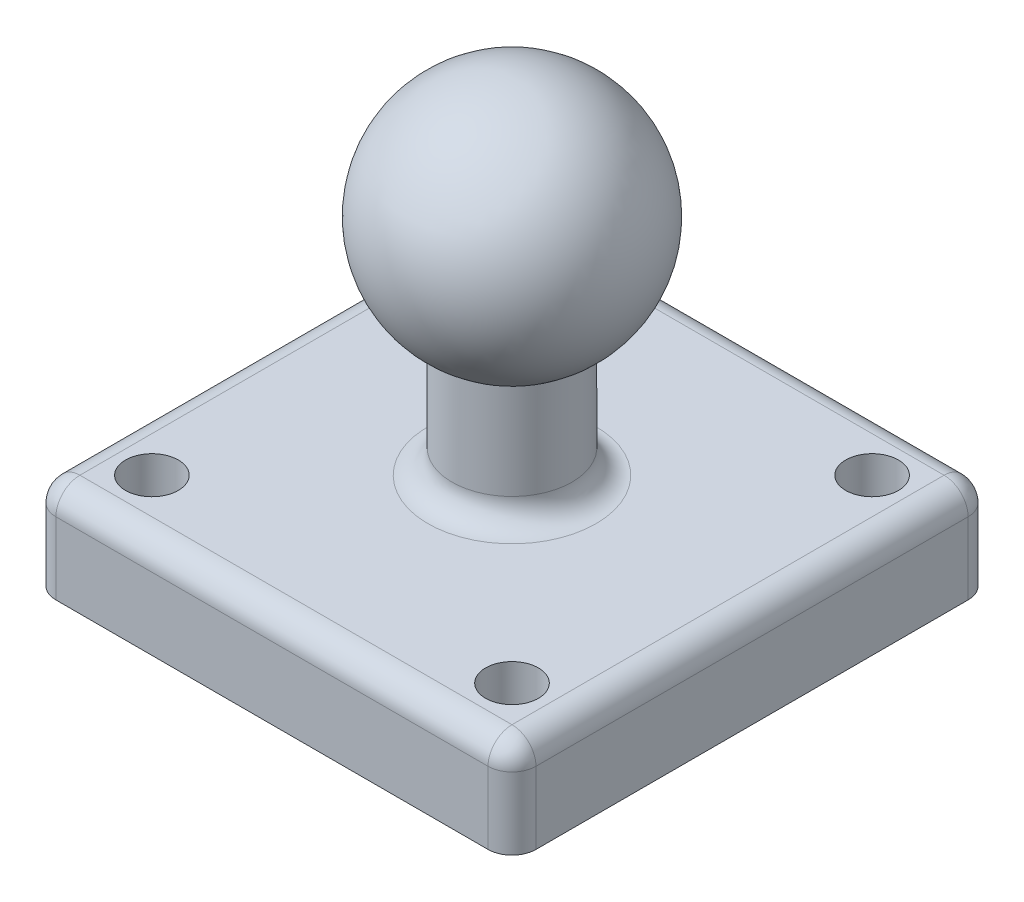
ISO-10303-21;
HEADER;
FILE_DESCRIPTION(('STEP AP214'),'2;1');
FILE_NAME('part.step','',(''),(''),'','','');
FILE_SCHEMA(('AUTOMOTIVE_DESIGN { 1 0 10303 214 1 1 1 1 }'));
ENDSEC;
DATA;
#1=APPLICATION_CONTEXT('core data for automotive mechanical design processes');
#2=APPLICATION_PROTOCOL_DEFINITION('international standard','automotive_design',2000,#1);
#3=PRODUCT_CONTEXT('',#1,'mechanical');
#4=PRODUCT('Part','Part','',(#3));
#5=PRODUCT_RELATED_PRODUCT_CATEGORY('part','',(#4));
#6=PRODUCT_DEFINITION_FORMATION('','',#4);
#7=PRODUCT_DEFINITION_CONTEXT('part definition',#1,'design');
#8=PRODUCT_DEFINITION('design','',#6,#7);
#9=PRODUCT_DEFINITION_SHAPE('','',#8);
#10=(LENGTH_UNIT() NAMED_UNIT(*) SI_UNIT(.MILLI.,.METRE.));
#11=(NAMED_UNIT(*) PLANE_ANGLE_UNIT() SI_UNIT($,.RADIAN.));
#12=(NAMED_UNIT(*) SI_UNIT($,.STERADIAN.) SOLID_ANGLE_UNIT());
#13=UNCERTAINTY_MEASURE_WITH_UNIT(LENGTH_MEASURE(1.E-05),#10,'distance_accuracy_value','');
#14=(GEOMETRIC_REPRESENTATION_CONTEXT(3) GLOBAL_UNCERTAINTY_ASSIGNED_CONTEXT((#13)) GLOBAL_UNIT_ASSIGNED_CONTEXT((#10,
#11,#12)) REPRESENTATION_CONTEXT('',''));
#15=CARTESIAN_POINT('',(0.,0.,0.));
#16=DIRECTION('',(0.,0.,1.));
#17=DIRECTION('',(1.,0.,0.));
#18=AXIS2_PLACEMENT_3D('',#15,#16,#17);
#19=CARTESIAN_POINT('',(0.,0.,0.));
#20=DIRECTION('',(0.,-1.,0.));
#21=DIRECTION('',(-1.,0.,0.));
#22=AXIS2_PLACEMENT_3D('',#19,#20,#21);
#23=SPHERICAL_SURFACE('',#22,5.);
#24=CARTESIAN_POINT('',(0.,-4.33012701892219,0.));
#25=DIRECTION('',(0.,-1.,0.));
#26=DIRECTION('',(1.,0.,0.));
#27=AXIS2_PLACEMENT_3D('',#24,#25,#26);
#28=CIRCLE('',#27,2.49999999999999);
#29=CARTESIAN_POINT('',(2.49999999999999,-4.33012701892219,0.));
#30=VERTEX_POINT('',#29);
#31=EDGE_CURVE('E234',#30,#30,#28,.T.);
#32=ORIENTED_EDGE('',*,*,#31,.F.);
#33=EDGE_LOOP('',(#32));
#34=FACE_BOUND('',#33,.T.);
#35=ADVANCED_FACE('F35',(#34),#23,.T.);
#36=CARTESIAN_POINT('',(0.,-9.33012701892219,0.));
#37=DIRECTION('',(0.,-1.,0.));
#38=DIRECTION('',(1.,0.,0.));
#39=AXIS2_PLACEMENT_3D('',#36,#37,#38);
#40=CYLINDRICAL_SURFACE('',#39,2.5);
#41=CARTESIAN_POINT('',(0.,-8.33012701892219,0.));
#42=DIRECTION('',(0.,-1.,0.));
#43=DIRECTION('',(1.,0.,0.));
#44=AXIS2_PLACEMENT_3D('',#41,#42,#43);
#45=CIRCLE('',#44,2.5);
#46=CARTESIAN_POINT('',(2.5,-8.33012701892219,0.));
#47=VERTEX_POINT('',#46);
#48=EDGE_CURVE('E172',#47,#47,#45,.F.);
#49=ORIENTED_EDGE('',*,*,#48,.T.);
#50=EDGE_LOOP('',(#49));
#51=FACE_BOUND('',#50,.T.);
#52=ORIENTED_EDGE('',*,*,#31,.T.);
#53=EDGE_LOOP('',(#52));
#54=FACE_BOUND('',#53,.T.);
#55=ADVANCED_FACE('F291',(#51,#54),#40,.T.);
#56=CARTESIAN_POINT('',(-9.99999999999999,-13.3301270189222,10.));
#57=DIRECTION('',(1.,0.,0.));
#58=DIRECTION('',(0.,1.,0.));
#59=AXIS2_PLACEMENT_3D('',#56,#57,#58);
#60=PLANE('',#59);
#61=DIRECTION('',(0.,0.,-1.));
#62=VECTOR('',#61,1.);
#63=CARTESIAN_POINT('',(-9.99999999999999,-13.3301270189222,10.));
#64=LINE('',#63,#62);
#65=CARTESIAN_POINT('',(-9.99999999999999,-13.3301270189222,9.));
#66=VERTEX_POINT('',#65);
#67=CARTESIAN_POINT('',(-9.99999999999999,-13.3301270189222,-9.));
#68=VERTEX_POINT('',#67);
#69=EDGE_CURVE('E116',#66,#68,#64,.T.);
#70=ORIENTED_EDGE('',*,*,#69,.F.);
#71=DIRECTION('',(0.,1.,0.));
#72=VECTOR('',#71,1.);
#73=CARTESIAN_POINT('',(-9.99999999999999,-13.3301270189222,9.));
#74=LINE('',#73,#72);
#75=CARTESIAN_POINT('',(-10.,-10.3301270189222,9.));
#76=VERTEX_POINT('',#75);
#77=EDGE_CURVE('E129',#66,#76,#74,.T.);
#78=ORIENTED_EDGE('',*,*,#77,.T.);
#79=DIRECTION('',(0.,0.,-1.));
#80=VECTOR('',#79,1.);
#81=CARTESIAN_POINT('',(-10.,-10.3301270189222,10.));
#82=LINE('',#81,#80);
#83=CARTESIAN_POINT('',(-10.,-10.3301270189222,-9.));
#84=VERTEX_POINT('',#83);
#85=EDGE_CURVE('E143',#76,#84,#82,.T.);
#86=ORIENTED_EDGE('',*,*,#85,.T.);
#87=DIRECTION('',(0.,1.,0.));
#88=VECTOR('',#87,1.);
#89=CARTESIAN_POINT('',(-9.99999999999999,-13.3301270189222,-9.));
#90=LINE('',#89,#88);
#91=EDGE_CURVE('E131',#84,#68,#90,.F.);
#92=ORIENTED_EDGE('',*,*,#91,.T.);
#93=EDGE_LOOP('',(#70,#78,#86,#92));
#94=FACE_BOUND('',#93,.T.);
#95=ADVANCED_FACE('F128',(#94),#60,.F.);
#96=CARTESIAN_POINT('',(-9.99999999999999,-13.3301270189222,-10.));
#97=DIRECTION('',(0.,0.,1.));
#98=DIRECTION('',(1.,0.,0.));
#99=AXIS2_PLACEMENT_3D('',#96,#97,#98);
#100=PLANE('',#99);
#101=DIRECTION('',(1.,0.,0.));
#102=VECTOR('',#101,1.);
#103=CARTESIAN_POINT('',(-9.99999999999999,-13.3301270189222,-10.));
#104=LINE('',#103,#102);
#105=CARTESIAN_POINT('',(-8.99999999999999,-13.3301270189222,-10.));
#106=VERTEX_POINT('',#105);
#107=CARTESIAN_POINT('',(9.00000000000001,-13.3301270189222,-10.));
#108=VERTEX_POINT('',#107);
#109=EDGE_CURVE('E132',#106,#108,#104,.T.);
#110=ORIENTED_EDGE('',*,*,#109,.F.);
#111=DIRECTION('',(0.,1.,0.));
#112=VECTOR('',#111,1.);
#113=CARTESIAN_POINT('',(-8.99999999999999,-13.3301270189222,-10.));
#114=LINE('',#113,#112);
#115=CARTESIAN_POINT('',(-9.,-10.3301270189222,-10.));
#116=VERTEX_POINT('',#115);
#117=EDGE_CURVE('E158',#106,#116,#114,.T.);
#118=ORIENTED_EDGE('',*,*,#117,.T.);
#119=DIRECTION('',(1.,0.,0.));
#120=VECTOR('',#119,1.);
#121=CARTESIAN_POINT('',(-10.,-10.3301270189222,-10.));
#122=LINE('',#121,#120);
#123=CARTESIAN_POINT('',(9.,-10.3301270189222,-10.));
#124=VERTEX_POINT('',#123);
#125=EDGE_CURVE('E156',#116,#124,#122,.T.);
#126=ORIENTED_EDGE('',*,*,#125,.T.);
#127=DIRECTION('',(0.,1.,0.));
#128=VECTOR('',#127,1.);
#129=CARTESIAN_POINT('',(9.00000000000001,-13.3301270189222,-10.));
#130=LINE('',#129,#128);
#131=EDGE_CURVE('E123',#124,#108,#130,.F.);
#132=ORIENTED_EDGE('',*,*,#131,.T.);
#133=EDGE_LOOP('',(#110,#118,#126,#132));
#134=FACE_BOUND('',#133,.T.);
#135=ADVANCED_FACE('F258',(#134),#100,.F.);
#136=CARTESIAN_POINT('',(10.,-13.3301270189222,10.));
#137=DIRECTION('',(-1.,0.,0.));
#138=DIRECTION('',(0.,-1.,0.));
#139=AXIS2_PLACEMENT_3D('',#136,#137,#138);
#140=PLANE('',#139);
#141=DIRECTION('',(0.,0.,1.));
#142=VECTOR('',#141,1.);
#143=CARTESIAN_POINT('',(10.,-13.3301270189222,10.));
#144=LINE('',#143,#142);
#145=CARTESIAN_POINT('',(10.,-13.3301270189222,-9.));
#146=VERTEX_POINT('',#145);
#147=CARTESIAN_POINT('',(10.,-13.3301270189222,9.));
#148=VERTEX_POINT('',#147);
#149=EDGE_CURVE('E230',#146,#148,#144,.T.);
#150=ORIENTED_EDGE('',*,*,#149,.F.);
#151=DIRECTION('',(0.,1.,0.));
#152=VECTOR('',#151,1.);
#153=CARTESIAN_POINT('',(10.,-13.3301270189222,-9.));
#154=LINE('',#153,#152);
#155=CARTESIAN_POINT('',(10.,-10.3301270189222,-9.));
#156=VERTEX_POINT('',#155);
#157=EDGE_CURVE('E11',#146,#156,#154,.T.);
#158=ORIENTED_EDGE('',*,*,#157,.T.);
#159=DIRECTION('',(0.,0.,1.));
#160=VECTOR('',#159,1.);
#161=CARTESIAN_POINT('',(10.,-10.3301270189222,10.));
#162=LINE('',#161,#160);
#163=CARTESIAN_POINT('',(10.,-10.3301270189222,9.));
#164=VERTEX_POINT('',#163);
#165=EDGE_CURVE('E51',#156,#164,#162,.T.);
#166=ORIENTED_EDGE('',*,*,#165,.T.);
#167=DIRECTION('',(0.,1.,0.));
#168=VECTOR('',#167,1.);
#169=CARTESIAN_POINT('',(10.,-13.3301270189222,9.));
#170=LINE('',#169,#168);
#171=EDGE_CURVE('E44',#164,#148,#170,.F.);
#172=ORIENTED_EDGE('',*,*,#171,.T.);
#173=EDGE_LOOP('',(#150,#158,#166,#172));
#174=FACE_BOUND('',#173,.T.);
#175=ADVANCED_FACE('F263',(#174),#140,.F.);
#176=CARTESIAN_POINT('',(-9.99999999999999,-13.3301270189222,10.));
#177=DIRECTION('',(0.,0.,-1.));
#178=DIRECTION('',(-1.,0.,0.));
#179=AXIS2_PLACEMENT_3D('',#176,#177,#178);
#180=PLANE('',#179);
#181=DIRECTION('',(-1.,0.,0.));
#182=VECTOR('',#181,1.);
#183=CARTESIAN_POINT('',(-10.,-10.3301270189222,10.));
#184=LINE('',#183,#182);
#185=CARTESIAN_POINT('',(9.,-10.3301270189222,10.));
#186=VERTEX_POINT('',#185);
#187=CARTESIAN_POINT('',(-9.,-10.3301270189222,10.));
#188=VERTEX_POINT('',#187);
#189=EDGE_CURVE('E139',#186,#188,#184,.T.);
#190=ORIENTED_EDGE('',*,*,#189,.T.);
#191=DIRECTION('',(0.,1.,0.));
#192=VECTOR('',#191,1.);
#193=CARTESIAN_POINT('',(-8.99999999999999,-13.3301270189222,10.));
#194=LINE('',#193,#192);
#195=CARTESIAN_POINT('',(-8.99999999999999,-13.3301270189222,10.));
#196=VERTEX_POINT('',#195);
#197=EDGE_CURVE('E148',#188,#196,#194,.F.);
#198=ORIENTED_EDGE('',*,*,#197,.T.);
#199=DIRECTION('',(-1.,0.,0.));
#200=VECTOR('',#199,1.);
#201=CARTESIAN_POINT('',(-9.99999999999999,-13.3301270189222,10.));
#202=LINE('',#201,#200);
#203=CARTESIAN_POINT('',(9.00000000000001,-13.3301270189222,10.));
#204=VERTEX_POINT('',#203);
#205=EDGE_CURVE('E119',#204,#196,#202,.T.);
#206=ORIENTED_EDGE('',*,*,#205,.F.);
#207=DIRECTION('',(0.,1.,0.));
#208=VECTOR('',#207,1.);
#209=CARTESIAN_POINT('',(9.00000000000001,-13.3301270189222,10.));
#210=LINE('',#209,#208);
#211=EDGE_CURVE('E141',#204,#186,#210,.T.);
#212=ORIENTED_EDGE('',*,*,#211,.T.);
#213=EDGE_LOOP('',(#190,#198,#206,#212));
#214=FACE_BOUND('',#213,.T.);
#215=ADVANCED_FACE('F279',(#214),#180,.F.);
#216=CARTESIAN_POINT('',(0.,-13.3301270189222,0.));
#217=DIRECTION('',(0.,-1.,0.));
#218=DIRECTION('',(1.,0.,0.));
#219=AXIS2_PLACEMENT_3D('',#216,#217,#218);
#220=PLANE('',#219);
#221=CARTESIAN_POINT('',(-7.49999999999998,-13.3301270189222,7.5));
#222=DIRECTION('',(0.,-1.,0.));
#223=DIRECTION('',(1.,0.,0.));
#224=AXIS2_PLACEMENT_3D('',#221,#222,#223);
#225=CIRCLE('',#224,1.1);
#226=CARTESIAN_POINT('',(-6.39999999999998,-13.3301270189222,7.5));
#227=VERTEX_POINT('',#226);
#228=EDGE_CURVE('E209',#227,#227,#225,.F.);
#229=ORIENTED_EDGE('',*,*,#228,.T.);
#230=EDGE_LOOP('',(#229));
#231=FACE_BOUND('',#230,.T.);
#232=CARTESIAN_POINT('',(-7.49999999999998,-13.3301270189222,-7.5));
#233=DIRECTION('',(0.,-1.,0.));
#234=DIRECTION('',(1.,0.,0.));
#235=AXIS2_PLACEMENT_3D('',#232,#233,#234);
#236=CIRCLE('',#235,1.1);
#237=CARTESIAN_POINT('',(-6.39999999999998,-13.3301270189222,-7.5));
#238=VERTEX_POINT('',#237);
#239=EDGE_CURVE('E218',#238,#238,#236,.F.);
#240=ORIENTED_EDGE('',*,*,#239,.T.);
#241=EDGE_LOOP('',(#240));
#242=FACE_BOUND('',#241,.T.);
#243=CARTESIAN_POINT('',(7.50000000000002,-13.3301270189222,-7.5));
#244=DIRECTION('',(0.,-1.,0.));
#245=DIRECTION('',(1.,0.,0.));
#246=AXIS2_PLACEMENT_3D('',#243,#244,#245);
#247=CIRCLE('',#246,1.1);
#248=CARTESIAN_POINT('',(8.60000000000002,-13.3301270189222,-7.5));
#249=VERTEX_POINT('',#248);
#250=EDGE_CURVE('E334',#249,#249,#247,.F.);
#251=ORIENTED_EDGE('',*,*,#250,.T.);
#252=EDGE_LOOP('',(#251));
#253=FACE_BOUND('',#252,.T.);
#254=CARTESIAN_POINT('',(7.50000000000002,-13.3301270189222,7.5));
#255=DIRECTION('',(0.,-1.,0.));
#256=DIRECTION('',(1.,0.,0.));
#257=AXIS2_PLACEMENT_3D('',#254,#255,#256);
#258=CIRCLE('',#257,1.1);
#259=CARTESIAN_POINT('',(8.60000000000002,-13.3301270189222,7.5));
#260=VERTEX_POINT('',#259);
#261=EDGE_CURVE('E224',#260,#260,#258,.F.);
#262=ORIENTED_EDGE('',*,*,#261,.T.);
#263=EDGE_LOOP('',(#262));
#264=FACE_BOUND('',#263,.T.);
#265=ORIENTED_EDGE('',*,*,#205,.T.);
#266=CARTESIAN_POINT('',(-8.99999999999999,-13.3301270189222,9.));
#267=DIRECTION('',(0.,-1.,0.));
#268=DIRECTION('',(1.,0.,0.));
#269=AXIS2_PLACEMENT_3D('',#266,#267,#268);
#270=CIRCLE('',#269,1.);
#271=EDGE_CURVE('E113',#196,#66,#270,.T.);
#272=ORIENTED_EDGE('',*,*,#271,.T.);
#273=ORIENTED_EDGE('',*,*,#69,.T.);
#274=CARTESIAN_POINT('',(-8.99999999999999,-13.3301270189222,-9.));
#275=DIRECTION('',(0.,-1.,0.));
#276=DIRECTION('',(1.,0.,0.));
#277=AXIS2_PLACEMENT_3D('',#274,#275,#276);
#278=CIRCLE('',#277,1.);
#279=EDGE_CURVE('E124',#68,#106,#278,.T.);
#280=ORIENTED_EDGE('',*,*,#279,.T.);
#281=ORIENTED_EDGE('',*,*,#109,.T.);
#282=CARTESIAN_POINT('',(9.00000000000001,-13.3301270189222,-9.));
#283=DIRECTION('',(0.,-1.,0.));
#284=DIRECTION('',(1.,0.,0.));
#285=AXIS2_PLACEMENT_3D('',#282,#283,#284);
#286=CIRCLE('',#285,1.);
#287=EDGE_CURVE('E152',#108,#146,#286,.T.);
#288=ORIENTED_EDGE('',*,*,#287,.T.);
#289=ORIENTED_EDGE('',*,*,#149,.T.);
#290=CARTESIAN_POINT('',(9.00000000000001,-13.3301270189222,9.));
#291=DIRECTION('',(0.,-1.,0.));
#292=DIRECTION('',(1.,0.,0.));
#293=AXIS2_PLACEMENT_3D('',#290,#291,#292);
#294=CIRCLE('',#293,1.);
#295=EDGE_CURVE('E150',#148,#204,#294,.T.);
#296=ORIENTED_EDGE('',*,*,#295,.T.);
#297=EDGE_LOOP('',(#265,#272,#273,#280,#281,#288,#289,#296));
#298=FACE_BOUND('',#297,.T.);
#299=ADVANCED_FACE('F115',(#231,#242,#253,#264,#298),#220,.T.);
#300=CARTESIAN_POINT('',(0.,-9.33012701892219,0.));
#301=DIRECTION('',(0.,-1.,0.));
#302=DIRECTION('',(1.,0.,0.));
#303=AXIS2_PLACEMENT_3D('',#300,#301,#302);
#304=PLANE('',#303);
#305=CARTESIAN_POINT('',(0.,-9.33012701892219,0.));
#306=DIRECTION('',(0.,-1.,0.));
#307=DIRECTION('',(1.,0.,0.));
#308=AXIS2_PLACEMENT_3D('',#305,#306,#307);
#309=CIRCLE('',#308,3.5);
#310=CARTESIAN_POINT('',(3.5,-9.33012701892219,0.));
#311=VERTEX_POINT('',#310);
#312=EDGE_CURVE('E169',#311,#311,#309,.T.);
#313=ORIENTED_EDGE('',*,*,#312,.T.);
#314=EDGE_LOOP('',(#313));
#315=FACE_BOUND('',#314,.T.);
#316=DIRECTION('',(1.,0.,0.));
#317=VECTOR('',#316,1.);
#318=CARTESIAN_POINT('',(0.,-9.33012701892219,-9.));
#319=LINE('',#318,#317);
#320=CARTESIAN_POINT('',(9.,-9.33012701892218,-9.));
#321=VERTEX_POINT('',#320);
#322=CARTESIAN_POINT('',(-9.,-9.3301270189222,-9.));
#323=VERTEX_POINT('',#322);
#324=EDGE_CURVE('E164',#321,#323,#319,.F.);
#325=ORIENTED_EDGE('',*,*,#324,.T.);
#326=DIRECTION('',(0.,0.,-1.));
#327=VECTOR('',#326,1.);
#328=CARTESIAN_POINT('',(-9.,-9.3301270189222,0.));
#329=LINE('',#328,#327);
#330=CARTESIAN_POINT('',(-9.,-9.3301270189222,9.));
#331=VERTEX_POINT('',#330);
#332=EDGE_CURVE('E166',#323,#331,#329,.F.);
#333=ORIENTED_EDGE('',*,*,#332,.T.);
#334=DIRECTION('',(-1.,0.,0.));
#335=VECTOR('',#334,1.);
#336=CARTESIAN_POINT('',(0.,-9.33012701892219,9.));
#337=LINE('',#336,#335);
#338=CARTESIAN_POINT('',(9.,-9.33012701892218,9.));
#339=VERTEX_POINT('',#338);
#340=EDGE_CURVE('E162',#331,#339,#337,.F.);
#341=ORIENTED_EDGE('',*,*,#340,.T.);
#342=DIRECTION('',(0.,0.,1.));
#343=VECTOR('',#342,1.);
#344=CARTESIAN_POINT('',(9.,-9.33012701892218,0.));
#345=LINE('',#344,#343);
#346=EDGE_CURVE('E160',#339,#321,#345,.F.);
#347=ORIENTED_EDGE('',*,*,#346,.T.);
#348=EDGE_LOOP('',(#325,#333,#341,#347));
#349=FACE_BOUND('',#348,.T.);
#350=CARTESIAN_POINT('',(-7.49999999999999,-9.3301270189222,7.5));
#351=DIRECTION('',(0.,1.,0.));
#352=DIRECTION('',(-1.,0.,0.));
#353=AXIS2_PLACEMENT_3D('',#350,#351,#352);
#354=CIRCLE('',#353,1.1);
#355=CARTESIAN_POINT('',(-8.59999999999999,-9.3301270189222,7.5));
#356=VERTEX_POINT('',#355);
#357=EDGE_CURVE('E213',#356,#356,#354,.T.);
#358=ORIENTED_EDGE('',*,*,#357,.F.);
#359=EDGE_LOOP('',(#358));
#360=FACE_BOUND('',#359,.T.);
#361=CARTESIAN_POINT('',(-7.49999999999999,-9.3301270189222,-7.5));
#362=DIRECTION('',(0.,1.,0.));
#363=DIRECTION('',(-1.,0.,0.));
#364=AXIS2_PLACEMENT_3D('',#361,#362,#363);
#365=CIRCLE('',#364,1.1);
#366=CARTESIAN_POINT('',(-8.59999999999999,-9.3301270189222,-7.5));
#367=VERTEX_POINT('',#366);
#368=EDGE_CURVE('E339',#367,#367,#365,.T.);
#369=ORIENTED_EDGE('',*,*,#368,.F.);
#370=EDGE_LOOP('',(#369));
#371=FACE_BOUND('',#370,.T.);
#372=CARTESIAN_POINT('',(7.50000000000001,-9.33012701892218,-7.5));
#373=DIRECTION('',(0.,1.,0.));
#374=DIRECTION('',(-1.,0.,0.));
#375=AXIS2_PLACEMENT_3D('',#372,#373,#374);
#376=CIRCLE('',#375,1.1);
#377=CARTESIAN_POINT('',(6.40000000000001,-9.33012701892219,-7.5));
#378=VERTEX_POINT('',#377);
#379=EDGE_CURVE('E226',#378,#378,#376,.T.);
#380=ORIENTED_EDGE('',*,*,#379,.F.);
#381=EDGE_LOOP('',(#380));
#382=FACE_BOUND('',#381,.T.);
#383=CARTESIAN_POINT('',(7.50000000000001,-9.33012701892218,7.5));
#384=DIRECTION('',(0.,1.,0.));
#385=DIRECTION('',(-1.,0.,0.));
#386=AXIS2_PLACEMENT_3D('',#383,#384,#385);
#387=CIRCLE('',#386,1.1);
#388=CARTESIAN_POINT('',(6.40000000000001,-9.33012701892219,7.5));
#389=VERTEX_POINT('',#388);
#390=EDGE_CURVE('E133',#389,#389,#387,.T.);
#391=ORIENTED_EDGE('',*,*,#390,.F.);
#392=EDGE_LOOP('',(#391));
#393=FACE_BOUND('',#392,.T.);
#394=ADVANCED_FACE('F251',(#315,#349,#360,#371,#382,#393),#304,.F.);
#395=CARTESIAN_POINT('',(7.50000000000002,-13.3311270189222,7.5));
#396=DIRECTION('',(0.,1.,0.));
#397=DIRECTION('',(-1.,0.,0.));
#398=AXIS2_PLACEMENT_3D('',#395,#396,#397);
#399=CYLINDRICAL_SURFACE('',#398,1.1);
#400=ORIENTED_EDGE('',*,*,#261,.F.);
#401=EDGE_LOOP('',(#400));
#402=FACE_BOUND('',#401,.T.);
#403=ORIENTED_EDGE('',*,*,#390,.T.);
#404=EDGE_LOOP('',(#403));
#405=FACE_BOUND('',#404,.T.);
#406=ADVANCED_FACE('F311',(#402,#405),#399,.F.);
#407=CARTESIAN_POINT('',(7.50000000000002,-13.3311270189222,-7.5));
#408=DIRECTION('',(0.,1.,0.));
#409=DIRECTION('',(-1.,0.,0.));
#410=AXIS2_PLACEMENT_3D('',#407,#408,#409);
#411=CYLINDRICAL_SURFACE('',#410,1.1);
#412=ORIENTED_EDGE('',*,*,#250,.F.);
#413=EDGE_LOOP('',(#412));
#414=FACE_BOUND('',#413,.T.);
#415=ORIENTED_EDGE('',*,*,#379,.T.);
#416=EDGE_LOOP('',(#415));
#417=FACE_BOUND('',#416,.T.);
#418=ADVANCED_FACE('F317',(#414,#417),#411,.F.);
#419=CARTESIAN_POINT('',(-7.49999999999998,-13.3311270189222,-7.5));
#420=DIRECTION('',(0.,1.,0.));
#421=DIRECTION('',(-1.,0.,0.));
#422=AXIS2_PLACEMENT_3D('',#419,#420,#421);
#423=CYLINDRICAL_SURFACE('',#422,1.1);
#424=ORIENTED_EDGE('',*,*,#239,.F.);
#425=EDGE_LOOP('',(#424));
#426=FACE_BOUND('',#425,.T.);
#427=ORIENTED_EDGE('',*,*,#368,.T.);
#428=EDGE_LOOP('',(#427));
#429=FACE_BOUND('',#428,.T.);
#430=ADVANCED_FACE('F322',(#426,#429),#423,.F.);
#431=CARTESIAN_POINT('',(-7.49999999999998,-13.3311270189222,7.5));
#432=DIRECTION('',(0.,1.,0.));
#433=DIRECTION('',(-1.,0.,0.));
#434=AXIS2_PLACEMENT_3D('',#431,#432,#433);
#435=CYLINDRICAL_SURFACE('',#434,1.1);
#436=ORIENTED_EDGE('',*,*,#228,.F.);
#437=EDGE_LOOP('',(#436));
#438=FACE_BOUND('',#437,.T.);
#439=ORIENTED_EDGE('',*,*,#357,.T.);
#440=EDGE_LOOP('',(#439));
#441=FACE_BOUND('',#440,.T.);
#442=ADVANCED_FACE('F319',(#438,#441),#435,.F.);
#443=CARTESIAN_POINT('',(9.00000000000001,-13.3301270189222,-9.));
#444=DIRECTION('',(0.,1.,0.));
#445=DIRECTION('',(-1.,0.,0.));
#446=AXIS2_PLACEMENT_3D('',#443,#444,#445);
#447=CYLINDRICAL_SURFACE('',#446,1.);
#448=CARTESIAN_POINT('',(9.00000000000001,-10.3301270189222,-9.));
#449=DIRECTION('',(0.,1.,0.));
#450=DIRECTION('',(-1.,0.,0.));
#451=AXIS2_PLACEMENT_3D('',#448,#449,#450);
#452=CIRCLE('',#451,1.);
#453=EDGE_CURVE('E39',#156,#124,#452,.T.);
#454=ORIENTED_EDGE('',*,*,#453,.F.);
#455=ORIENTED_EDGE('',*,*,#157,.F.);
#456=ORIENTED_EDGE('',*,*,#287,.F.);
#457=ORIENTED_EDGE('',*,*,#131,.F.);
#458=EDGE_LOOP('',(#454,#455,#456,#457));
#459=FACE_BOUND('',#458,.T.);
#460=ADVANCED_FACE('F261',(#459),#447,.T.);
#461=CARTESIAN_POINT('',(9.,-10.3301270189222,-9.));
#462=DIRECTION('',(0.,0.,1.));
#463=DIRECTION('',(1.,0.,0.));
#464=AXIS2_PLACEMENT_3D('',#461,#462,#463);
#465=SPHERICAL_SURFACE('',#464,1.);
#466=CARTESIAN_POINT('',(9.,-10.3301270189222,-9.));
#467=DIRECTION('',(0.,0.,-1.));
#468=DIRECTION('',(-1.,0.,0.));
#469=AXIS2_PLACEMENT_3D('',#466,#467,#468);
#470=CIRCLE('',#469,1.);
#471=EDGE_CURVE('E200',#156,#321,#470,.F.);
#472=ORIENTED_EDGE('',*,*,#471,.F.);
#473=ORIENTED_EDGE('',*,*,#453,.T.);
#474=CARTESIAN_POINT('',(9.,-10.3301270189222,-9.));
#475=DIRECTION('',(1.,0.,0.));
#476=DIRECTION('',(0.,1.,0.));
#477=AXIS2_PLACEMENT_3D('',#474,#475,#476);
#478=CIRCLE('',#477,1.);
#479=EDGE_CURVE('E202',#321,#124,#478,.F.);
#480=ORIENTED_EDGE('',*,*,#479,.F.);
#481=EDGE_LOOP('',(#472,#473,#480));
#482=FACE_BOUND('',#481,.T.);
#483=ADVANCED_FACE('F372',(#482),#465,.T.);
#484=CARTESIAN_POINT('',(-8.99999999999999,-13.3301270189222,-9.));
#485=DIRECTION('',(0.,1.,0.));
#486=DIRECTION('',(-1.,0.,0.));
#487=AXIS2_PLACEMENT_3D('',#484,#485,#486);
#488=CYLINDRICAL_SURFACE('',#487,1.);
#489=ORIENTED_EDGE('',*,*,#279,.F.);
#490=ORIENTED_EDGE('',*,*,#91,.F.);
#491=CARTESIAN_POINT('',(-9.,-10.3301270189222,-9.));
#492=DIRECTION('',(0.,1.,0.));
#493=DIRECTION('',(-1.,0.,0.));
#494=AXIS2_PLACEMENT_3D('',#491,#492,#493);
#495=CIRCLE('',#494,1.);
#496=EDGE_CURVE('E197',#116,#84,#495,.T.);
#497=ORIENTED_EDGE('',*,*,#496,.F.);
#498=ORIENTED_EDGE('',*,*,#117,.F.);
#499=EDGE_LOOP('',(#489,#490,#497,#498));
#500=FACE_BOUND('',#499,.T.);
#501=ADVANCED_FACE('F241',(#500),#488,.T.);
#502=CARTESIAN_POINT('',(-10.,-10.3301270189222,-9.));
#503=DIRECTION('',(1.,0.,0.));
#504=DIRECTION('',(0.,1.,0.));
#505=AXIS2_PLACEMENT_3D('',#502,#503,#504);
#506=CYLINDRICAL_SURFACE('',#505,1.);
#507=ORIENTED_EDGE('',*,*,#479,.T.);
#508=ORIENTED_EDGE('',*,*,#125,.F.);
#509=CARTESIAN_POINT('',(-9.,-10.3301270189222,-9.));
#510=DIRECTION('',(-1.,0.,0.));
#511=DIRECTION('',(0.,-1.,0.));
#512=AXIS2_PLACEMENT_3D('',#509,#510,#511);
#513=CIRCLE('',#512,1.);
#514=EDGE_CURVE('E194',#323,#116,#513,.T.);
#515=ORIENTED_EDGE('',*,*,#514,.F.);
#516=ORIENTED_EDGE('',*,*,#324,.F.);
#517=EDGE_LOOP('',(#507,#508,#515,#516));
#518=FACE_BOUND('',#517,.T.);
#519=ADVANCED_FACE('F254',(#518),#506,.T.);
#520=CARTESIAN_POINT('',(9.,-10.3301270189222,10.));
#521=DIRECTION('',(0.,0.,1.));
#522=DIRECTION('',(1.,0.,0.));
#523=AXIS2_PLACEMENT_3D('',#520,#521,#522);
#524=CYLINDRICAL_SURFACE('',#523,1.);
#525=ORIENTED_EDGE('',*,*,#471,.T.);
#526=ORIENTED_EDGE('',*,*,#346,.F.);
#527=CARTESIAN_POINT('',(9.,-10.3301270189222,9.));
#528=DIRECTION('',(0.,0.,1.));
#529=DIRECTION('',(1.,0.,0.));
#530=AXIS2_PLACEMENT_3D('',#527,#528,#529);
#531=CIRCLE('',#530,1.);
#532=EDGE_CURVE('E191',#164,#339,#531,.T.);
#533=ORIENTED_EDGE('',*,*,#532,.F.);
#534=ORIENTED_EDGE('',*,*,#165,.F.);
#535=EDGE_LOOP('',(#525,#526,#533,#534));
#536=FACE_BOUND('',#535,.T.);
#537=ADVANCED_FACE('F271',(#536),#524,.T.);
#538=CARTESIAN_POINT('',(9.00000000000001,-13.3301270189222,9.));
#539=DIRECTION('',(0.,1.,0.));
#540=DIRECTION('',(-1.,0.,0.));
#541=AXIS2_PLACEMENT_3D('',#538,#539,#540);
#542=CYLINDRICAL_SURFACE('',#541,1.);
#543=ORIENTED_EDGE('',*,*,#295,.F.);
#544=ORIENTED_EDGE('',*,*,#171,.F.);
#545=CARTESIAN_POINT('',(9.,-10.3301270189222,9.));
#546=DIRECTION('',(0.,1.,0.));
#547=DIRECTION('',(-1.,0.,0.));
#548=AXIS2_PLACEMENT_3D('',#545,#546,#547);
#549=CIRCLE('',#548,1.);
#550=EDGE_CURVE('E188',#186,#164,#549,.T.);
#551=ORIENTED_EDGE('',*,*,#550,.F.);
#552=ORIENTED_EDGE('',*,*,#211,.F.);
#553=EDGE_LOOP('',(#543,#544,#551,#552));
#554=FACE_BOUND('',#553,.T.);
#555=ADVANCED_FACE('F267',(#554),#542,.T.);
#556=CARTESIAN_POINT('',(-9.,-10.3301270189222,-9.));
#557=DIRECTION('',(0.,0.,1.));
#558=DIRECTION('',(1.,0.,0.));
#559=AXIS2_PLACEMENT_3D('',#556,#557,#558);
#560=SPHERICAL_SURFACE('',#559,1.);
#561=ORIENTED_EDGE('',*,*,#514,.T.);
#562=ORIENTED_EDGE('',*,*,#496,.T.);
#563=CARTESIAN_POINT('',(-9.,-10.3301270189222,-9.));
#564=DIRECTION('',(0.,0.,-1.));
#565=DIRECTION('',(-1.,0.,0.));
#566=AXIS2_PLACEMENT_3D('',#563,#564,#565);
#567=CIRCLE('',#566,1.);
#568=EDGE_CURVE('E185',#323,#84,#567,.F.);
#569=ORIENTED_EDGE('',*,*,#568,.F.);
#570=EDGE_LOOP('',(#561,#562,#569));
#571=FACE_BOUND('',#570,.T.);
#572=ADVANCED_FACE('F245',(#571),#560,.T.);
#573=CARTESIAN_POINT('',(9.,-10.3301270189222,9.));
#574=DIRECTION('',(0.,0.,1.));
#575=DIRECTION('',(1.,0.,0.));
#576=AXIS2_PLACEMENT_3D('',#573,#574,#575);
#577=SPHERICAL_SURFACE('',#576,1.);
#578=ORIENTED_EDGE('',*,*,#550,.T.);
#579=ORIENTED_EDGE('',*,*,#532,.T.);
#580=CARTESIAN_POINT('',(9.,-10.3301270189222,9.));
#581=DIRECTION('',(1.,0.,0.));
#582=DIRECTION('',(0.,1.,0.));
#583=AXIS2_PLACEMENT_3D('',#580,#581,#582);
#584=CIRCLE('',#583,1.);
#585=EDGE_CURVE('E182',#186,#339,#584,.F.);
#586=ORIENTED_EDGE('',*,*,#585,.F.);
#587=EDGE_LOOP('',(#578,#579,#586));
#588=FACE_BOUND('',#587,.T.);
#589=ADVANCED_FACE('F273',(#588),#577,.T.);
#590=CARTESIAN_POINT('',(-9.,-10.3301270189222,10.));
#591=DIRECTION('',(0.,0.,-1.));
#592=DIRECTION('',(-1.,0.,0.));
#593=AXIS2_PLACEMENT_3D('',#590,#591,#592);
#594=CYLINDRICAL_SURFACE('',#593,1.);
#595=ORIENTED_EDGE('',*,*,#568,.T.);
#596=ORIENTED_EDGE('',*,*,#85,.F.);
#597=CARTESIAN_POINT('',(-9.,-10.3301270189222,9.));
#598=DIRECTION('',(0.,0.,1.));
#599=DIRECTION('',(1.,0.,0.));
#600=AXIS2_PLACEMENT_3D('',#597,#598,#599);
#601=CIRCLE('',#600,1.);
#602=EDGE_CURVE('E180',#331,#76,#601,.T.);
#603=ORIENTED_EDGE('',*,*,#602,.F.);
#604=ORIENTED_EDGE('',*,*,#332,.F.);
#605=EDGE_LOOP('',(#595,#596,#603,#604));
#606=FACE_BOUND('',#605,.T.);
#607=ADVANCED_FACE('F248',(#606),#594,.T.);
#608=CARTESIAN_POINT('',(-10.,-10.3301270189222,9.));
#609=DIRECTION('',(-1.,0.,0.));
#610=DIRECTION('',(0.,-1.,0.));
#611=AXIS2_PLACEMENT_3D('',#608,#609,#610);
#612=CYLINDRICAL_SURFACE('',#611,1.);
#613=ORIENTED_EDGE('',*,*,#585,.T.);
#614=ORIENTED_EDGE('',*,*,#340,.F.);
#615=CARTESIAN_POINT('',(-9.,-10.3301270189222,9.));
#616=DIRECTION('',(-1.,0.,0.));
#617=DIRECTION('',(0.,-1.,0.));
#618=AXIS2_PLACEMENT_3D('',#615,#616,#617);
#619=CIRCLE('',#618,1.);
#620=EDGE_CURVE('E178',#188,#331,#619,.T.);
#621=ORIENTED_EDGE('',*,*,#620,.F.);
#622=ORIENTED_EDGE('',*,*,#189,.F.);
#623=EDGE_LOOP('',(#613,#614,#621,#622));
#624=FACE_BOUND('',#623,.T.);
#625=ADVANCED_FACE('F277',(#624),#612,.T.);
#626=CARTESIAN_POINT('',(-9.,-10.3301270189222,9.));
#627=DIRECTION('',(0.,0.,1.));
#628=DIRECTION('',(1.,0.,0.));
#629=AXIS2_PLACEMENT_3D('',#626,#627,#628);
#630=SPHERICAL_SURFACE('',#629,1.);
#631=ORIENTED_EDGE('',*,*,#620,.T.);
#632=ORIENTED_EDGE('',*,*,#602,.T.);
#633=CARTESIAN_POINT('',(-9.,-10.3301270189222,9.));
#634=DIRECTION('',(0.,1.,0.));
#635=DIRECTION('',(-1.,0.,0.));
#636=AXIS2_PLACEMENT_3D('',#633,#634,#635);
#637=CIRCLE('',#636,1.);
#638=EDGE_CURVE('E137',#188,#76,#637,.F.);
#639=ORIENTED_EDGE('',*,*,#638,.F.);
#640=EDGE_LOOP('',(#631,#632,#639));
#641=FACE_BOUND('',#640,.T.);
#642=ADVANCED_FACE('F281',(#641),#630,.T.);
#643=CARTESIAN_POINT('',(-8.99999999999999,-13.3301270189222,9.));
#644=DIRECTION('',(0.,1.,0.));
#645=DIRECTION('',(-1.,0.,0.));
#646=AXIS2_PLACEMENT_3D('',#643,#644,#645);
#647=CYLINDRICAL_SURFACE('',#646,1.);
#648=ORIENTED_EDGE('',*,*,#271,.F.);
#649=ORIENTED_EDGE('',*,*,#197,.F.);
#650=ORIENTED_EDGE('',*,*,#638,.T.);
#651=ORIENTED_EDGE('',*,*,#77,.F.);
#652=EDGE_LOOP('',(#648,#649,#650,#651));
#653=FACE_BOUND('',#652,.T.);
#654=ADVANCED_FACE('F135',(#653),#647,.T.);
#655=CARTESIAN_POINT('',(0.,-8.33012701892219,0.));
#656=DIRECTION('',(0.,-1.,0.));
#657=DIRECTION('',(1.,0.,0.));
#658=AXIS2_PLACEMENT_3D('',#655,#656,#657);
#659=TOROIDAL_SURFACE('',#658,3.5,1.);
#660=ORIENTED_EDGE('',*,*,#48,.F.);
#661=EDGE_LOOP('',(#660));
#662=FACE_BOUND('',#661,.T.);
#663=ORIENTED_EDGE('',*,*,#312,.F.);
#664=EDGE_LOOP('',(#663));
#665=FACE_BOUND('',#664,.T.);
#666=ADVANCED_FACE('F37',(#662,#665),#659,.F.);
#667=CLOSED_SHELL('',(#35,#55,#95,#135,#175,#215,#299,#394,#406,#418,#430,#442,#460,#483,#501,
#519,#537,#555,#572,#589,#607,#625,#642,#654,#666));
#668=MANIFOLD_SOLID_BREP('B2',#667);
#669=ADVANCED_BREP_SHAPE_REPRESENTATION('',(#18,#668),#14);
#670=SHAPE_DEFINITION_REPRESENTATION(#9,#669);
ENDSEC;
END-ISO-10303-21;
